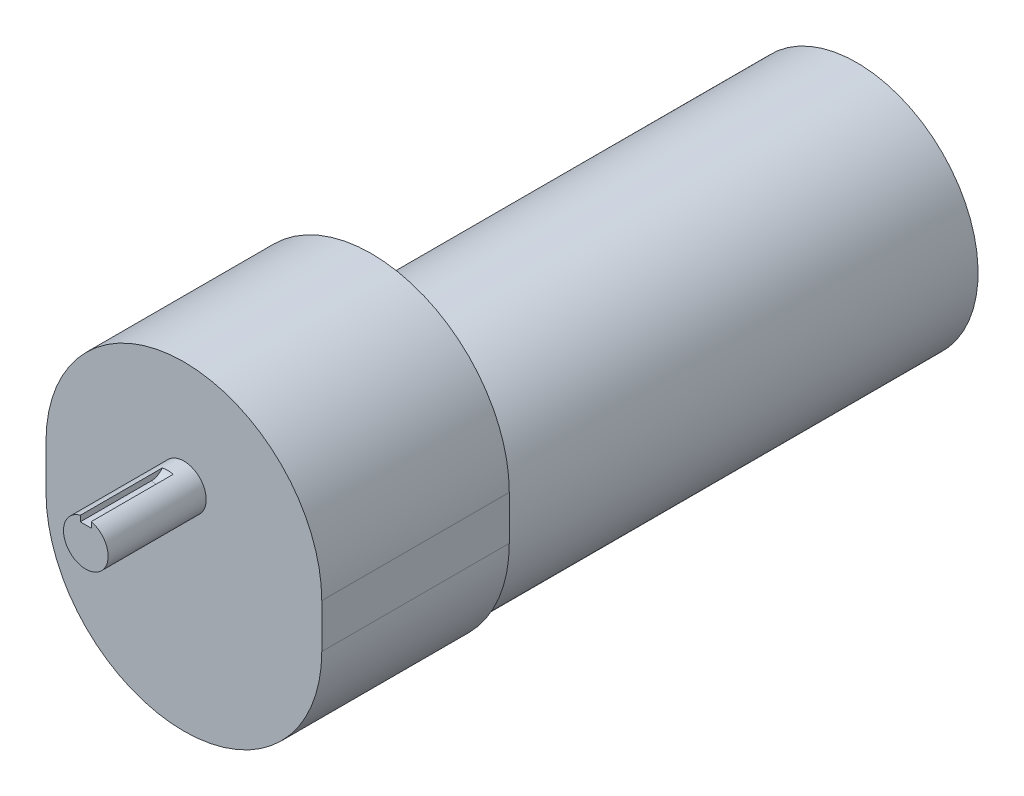
ISO-10303-21;
HEADER;
FILE_DESCRIPTION(('STEP AP214'),'2;1');
FILE_NAME('part.step','',(''),(''),'','','');
FILE_SCHEMA(('AUTOMOTIVE_DESIGN { 1 0 10303 214 1 1 1 1 }'));
ENDSEC;
DATA;
#1=APPLICATION_CONTEXT('core data for automotive mechanical design processes');
#2=APPLICATION_PROTOCOL_DEFINITION('international standard','automotive_design',2000,#1);
#3=PRODUCT_CONTEXT('',#1,'mechanical');
#4=PRODUCT('Part','Part','',(#3));
#5=PRODUCT_RELATED_PRODUCT_CATEGORY('part','',(#4));
#6=PRODUCT_DEFINITION_FORMATION('','',#4);
#7=PRODUCT_DEFINITION_CONTEXT('part definition',#1,'design');
#8=PRODUCT_DEFINITION('design','',#6,#7);
#9=PRODUCT_DEFINITION_SHAPE('','',#8);
#10=(LENGTH_UNIT() NAMED_UNIT(*) SI_UNIT(.MILLI.,.METRE.));
#11=(NAMED_UNIT(*) PLANE_ANGLE_UNIT() SI_UNIT($,.RADIAN.));
#12=(NAMED_UNIT(*) SI_UNIT($,.STERADIAN.) SOLID_ANGLE_UNIT());
#13=UNCERTAINTY_MEASURE_WITH_UNIT(LENGTH_MEASURE(1.E-05),#10,'distance_accuracy_value','');
#14=(GEOMETRIC_REPRESENTATION_CONTEXT(3) GLOBAL_UNCERTAINTY_ASSIGNED_CONTEXT((#13)) GLOBAL_UNIT_ASSIGNED_CONTEXT((#10,
#11,#12)) REPRESENTATION_CONTEXT('',''));
#15=CARTESIAN_POINT('',(0.,0.,0.));
#16=DIRECTION('',(0.,0.,1.));
#17=DIRECTION('',(1.,0.,0.));
#18=AXIS2_PLACEMENT_3D('',#15,#16,#17);
#19=CARTESIAN_POINT('',(0.,0.,-56.4642));
#20=DIRECTION('',(0.,0.,1.));
#21=DIRECTION('',(1.,0.,0.));
#22=AXIS2_PLACEMENT_3D('',#19,#20,#21);
#23=CYLINDRICAL_SURFACE('',#22,12.84605);
#24=DIRECTION('',(0.,0.,1.));
#25=VECTOR('',#24,1.);
#26=CARTESIAN_POINT('',(-3.1623,12.4507372999554,-47.1297));
#27=LINE('',#26,#25);
#28=CARTESIAN_POINT('',(-3.1623,12.4507372999554,-47.1297));
#29=VERTEX_POINT('',#28);
#30=CARTESIAN_POINT('',(-3.1623,12.4507372999554,0.));
#31=VERTEX_POINT('',#30);
#32=EDGE_CURVE('E117',#29,#31,#27,.T.);
#33=ORIENTED_EDGE('',*,*,#32,.F.);
#34=CARTESIAN_POINT('',(0.,-4.61436444609831E-13,-47.1297));
#35=DIRECTION('',(0.,0.,-1.));
#36=DIRECTION('',(-1.,0.,0.));
#37=AXIS2_PLACEMENT_3D('',#34,#35,#36);
#38=CIRCLE('',#37,12.8460500000004);
#39=CARTESIAN_POINT('',(3.1623,12.4507372999554,-47.1297));
#40=VERTEX_POINT('',#39);
#41=EDGE_CURVE('E106',#29,#40,#38,.T.);
#42=ORIENTED_EDGE('',*,*,#41,.T.);
#43=DIRECTION('',(0.,0.,1.));
#44=VECTOR('',#43,1.);
#45=CARTESIAN_POINT('',(3.1623,12.4507372999554,-47.1297));
#46=LINE('',#45,#44);
#47=CARTESIAN_POINT('',(3.1623,12.4507372999554,0.));
#48=VERTEX_POINT('',#47);
#49=EDGE_CURVE('E110',#40,#48,#46,.T.);
#50=ORIENTED_EDGE('',*,*,#49,.T.);
#51=CARTESIAN_POINT('',(0.,0.,0.));
#52=DIRECTION('',(0.,0.,1.));
#53=DIRECTION('',(1.,0.,0.));
#54=AXIS2_PLACEMENT_3D('',#51,#52,#53);
#55=CIRCLE('',#54,12.84605);
#56=EDGE_CURVE('E107',#31,#48,#55,.T.);
#57=ORIENTED_EDGE('',*,*,#56,.F.);
#58=EDGE_LOOP('',(#33,#42,#50,#57));
#59=FACE_BOUND('',#58,.T.);
#60=CARTESIAN_POINT('',(0.,0.,-56.4642));
#61=DIRECTION('',(0.,0.,1.));
#62=DIRECTION('',(1.,0.,0.));
#63=AXIS2_PLACEMENT_3D('',#60,#61,#62);
#64=CIRCLE('',#63,12.84605);
#65=CARTESIAN_POINT('',(12.84605,0.,-56.4642));
#66=VERTEX_POINT('',#65);
#67=EDGE_CURVE('E172',#66,#66,#64,.T.);
#68=ORIENTED_EDGE('',*,*,#67,.T.);
#69=EDGE_LOOP('',(#68));
#70=FACE_BOUND('',#69,.T.);
#71=ADVANCED_FACE('F32',(#59,#70),#23,.T.);
#72=CARTESIAN_POINT('',(0.,0.,0.));
#73=DIRECTION('',(0.,0.,1.));
#74=DIRECTION('',(1.,0.,0.));
#75=AXIS2_PLACEMENT_3D('',#72,#73,#74);
#76=PLANE('',#75);
#77=DIRECTION('',(0.,-1.,0.));
#78=VECTOR('',#77,1.);
#79=CARTESIAN_POINT('',(-3.1623,12.4507372999554,0.));
#80=LINE('',#79,#78);
#81=CARTESIAN_POINT('',(-3.1623,9.14873729995537,0.));
#82=VERTEX_POINT('',#81);
#83=EDGE_CURVE('E128',#31,#82,#80,.T.);
#84=ORIENTED_EDGE('',*,*,#83,.F.);
#85=ORIENTED_EDGE('',*,*,#56,.T.);
#86=DIRECTION('',(0.,1.,0.));
#87=VECTOR('',#86,1.);
#88=CARTESIAN_POINT('',(3.1623,9.14873729995537,0.));
#89=LINE('',#88,#87);
#90=CARTESIAN_POINT('',(3.1623,9.14873729995537,0.));
#91=VERTEX_POINT('',#90);
#92=EDGE_CURVE('E113',#91,#48,#89,.T.);
#93=ORIENTED_EDGE('',*,*,#92,.F.);
#94=DIRECTION('',(1.,0.,0.));
#95=VECTOR('',#94,1.);
#96=CARTESIAN_POINT('',(-3.1623,9.14873729995537,0.));
#97=LINE('',#96,#95);
#98=EDGE_CURVE('E125',#82,#91,#97,.T.);
#99=ORIENTED_EDGE('',*,*,#98,.F.);
#100=EDGE_LOOP('',(#84,#85,#93,#99));
#101=FACE_BOUND('',#100,.T.);
#102=ADVANCED_FACE('F217',(#101),#76,.T.);
#103=CARTESIAN_POINT('',(0.,-17.08785,-164.4142));
#104=DIRECTION('',(0.,0.,1.));
#105=DIRECTION('',(1.,0.,0.));
#106=AXIS2_PLACEMENT_3D('',#103,#104,#105);
#107=CYLINDRICAL_SURFACE('',#106,79.375);
#108=CARTESIAN_POINT('',(0.,-17.08785,-56.4642));
#109=DIRECTION('',(0.,0.,-1.));
#110=DIRECTION('',(-1.,0.,0.));
#111=AXIS2_PLACEMENT_3D('',#108,#109,#110);
#112=CIRCLE('',#111,79.375);
#113=CARTESIAN_POINT('',(-79.375,-17.08785,-56.4642));
#114=VERTEX_POINT('',#113);
#115=CARTESIAN_POINT('',(79.375,-17.08785,-56.4642));
#116=VERTEX_POINT('',#115);
#117=EDGE_CURVE('E139',#114,#116,#112,.T.);
#118=ORIENTED_EDGE('',*,*,#117,.T.);
#119=DIRECTION('',(0.,0.,1.));
#120=VECTOR('',#119,1.);
#121=CARTESIAN_POINT('',(79.375,-17.08785,-164.4142));
#122=LINE('',#121,#120);
#123=CARTESIAN_POINT('',(79.375,-17.08785,-164.4142));
#124=VERTEX_POINT('',#123);
#125=EDGE_CURVE('E169',#124,#116,#122,.T.);
#126=ORIENTED_EDGE('',*,*,#125,.F.);
#127=CARTESIAN_POINT('',(0.,-17.08785,-164.4142));
#128=DIRECTION('',(0.,0.,-1.));
#129=DIRECTION('',(-1.,0.,0.));
#130=AXIS2_PLACEMENT_3D('',#127,#128,#129);
#131=CIRCLE('',#130,79.375);
#132=CARTESIAN_POINT('',(-79.375,-17.08785,-164.4142));
#133=VERTEX_POINT('',#132);
#134=EDGE_CURVE('E142',#133,#124,#131,.T.);
#135=ORIENTED_EDGE('',*,*,#134,.F.);
#136=DIRECTION('',(0.,0.,1.));
#137=VECTOR('',#136,1.);
#138=CARTESIAN_POINT('',(-79.375,-17.08785,-164.4142));
#139=LINE('',#138,#137);
#140=EDGE_CURVE('E153',#133,#114,#139,.T.);
#141=ORIENTED_EDGE('',*,*,#140,.T.);
#142=EDGE_LOOP('',(#118,#126,#135,#141));
#143=FACE_BOUND('',#142,.T.);
#144=ADVANCED_FACE('F221',(#143),#107,.T.);
#145=CARTESIAN_POINT('',(79.375,-17.08785,-164.4142));
#146=DIRECTION('',(-1.,0.,0.));
#147=DIRECTION('',(0.,-1.,0.));
#148=AXIS2_PLACEMENT_3D('',#145,#146,#147);
#149=PLANE('',#148);
#150=DIRECTION('',(0.,-1.,0.));
#151=VECTOR('',#150,1.);
#152=CARTESIAN_POINT('',(79.375,-17.08785,-56.4642));
#153=LINE('',#152,#151);
#154=CARTESIAN_POINT('',(79.375,-42.48785,-56.4642));
#155=VERTEX_POINT('',#154);
#156=EDGE_CURVE('E156',#116,#155,#153,.T.);
#157=ORIENTED_EDGE('',*,*,#156,.T.);
#158=DIRECTION('',(0.,0.,1.));
#159=VECTOR('',#158,1.);
#160=CARTESIAN_POINT('',(79.375,-42.48785,-164.4142));
#161=LINE('',#160,#159);
#162=CARTESIAN_POINT('',(79.375,-42.48785,-164.4142));
#163=VERTEX_POINT('',#162);
#164=EDGE_CURVE('E166',#163,#155,#161,.T.);
#165=ORIENTED_EDGE('',*,*,#164,.F.);
#166=DIRECTION('',(0.,-1.,0.));
#167=VECTOR('',#166,1.);
#168=CARTESIAN_POINT('',(79.375,-17.08785,-164.4142));
#169=LINE('',#168,#167);
#170=EDGE_CURVE('E145',#124,#163,#169,.T.);
#171=ORIENTED_EDGE('',*,*,#170,.F.);
#172=ORIENTED_EDGE('',*,*,#125,.T.);
#173=EDGE_LOOP('',(#157,#165,#171,#172));
#174=FACE_BOUND('',#173,.T.);
#175=ADVANCED_FACE('F225',(#174),#149,.F.);
#176=CARTESIAN_POINT('',(0.,-42.48785,-164.4142));
#177=DIRECTION('',(0.,0.,1.));
#178=DIRECTION('',(1.,0.,0.));
#179=AXIS2_PLACEMENT_3D('',#176,#177,#178);
#180=CYLINDRICAL_SURFACE('',#179,79.375);
#181=CARTESIAN_POINT('',(0.,-42.48785,-56.4642));
#182=DIRECTION('',(0.,0.,-1.));
#183=DIRECTION('',(-1.,0.,0.));
#184=AXIS2_PLACEMENT_3D('',#181,#182,#183);
#185=CIRCLE('',#184,79.375);
#186=CARTESIAN_POINT('',(-79.375,-42.48785,-56.4642));
#187=VERTEX_POINT('',#186);
#188=EDGE_CURVE('E158',#155,#187,#185,.T.);
#189=ORIENTED_EDGE('',*,*,#188,.T.);
#190=DIRECTION('',(0.,0.,1.));
#191=VECTOR('',#190,1.);
#192=CARTESIAN_POINT('',(-79.375,-42.48785,-164.4142));
#193=LINE('',#192,#191);
#194=CARTESIAN_POINT('',(-79.375,-42.48785,-164.4142));
#195=VERTEX_POINT('',#194);
#196=EDGE_CURVE('E163',#195,#187,#193,.T.);
#197=ORIENTED_EDGE('',*,*,#196,.F.);
#198=CARTESIAN_POINT('',(0.,-42.48785,-164.4142));
#199=DIRECTION('',(0.,0.,-1.));
#200=DIRECTION('',(-1.,0.,0.));
#201=AXIS2_PLACEMENT_3D('',#198,#199,#200);
#202=CIRCLE('',#201,79.375);
#203=CARTESIAN_POINT('',(0.,-121.86285,-164.4142));
#204=VERTEX_POINT('',#203);
#205=EDGE_CURVE('E148',#204,#195,#202,.T.);
#206=ORIENTED_EDGE('',*,*,#205,.F.);
#207=EDGE_CURVE('E149',#163,#204,#202,.T.);
#208=ORIENTED_EDGE('',*,*,#207,.F.);
#209=ORIENTED_EDGE('',*,*,#164,.T.);
#210=EDGE_LOOP('',(#189,#197,#206,#208,#209));
#211=FACE_BOUND('',#210,.T.);
#212=ADVANCED_FACE('F229',(#211),#180,.T.);
#213=CARTESIAN_POINT('',(-79.375,-17.08785,-164.4142));
#214=DIRECTION('',(1.,0.,0.));
#215=DIRECTION('',(0.,1.,0.));
#216=AXIS2_PLACEMENT_3D('',#213,#214,#215);
#217=PLANE('',#216);
#218=DIRECTION('',(0.,1.,0.));
#219=VECTOR('',#218,1.);
#220=CARTESIAN_POINT('',(-79.375,-17.08785,-56.4642));
#221=LINE('',#220,#219);
#222=EDGE_CURVE('E146',#187,#114,#221,.T.);
#223=ORIENTED_EDGE('',*,*,#222,.T.);
#224=ORIENTED_EDGE('',*,*,#140,.F.);
#225=DIRECTION('',(0.,1.,0.));
#226=VECTOR('',#225,1.);
#227=CARTESIAN_POINT('',(-79.375,-17.08785,-164.4142));
#228=LINE('',#227,#226);
#229=EDGE_CURVE('E151',#195,#133,#228,.T.);
#230=ORIENTED_EDGE('',*,*,#229,.F.);
#231=ORIENTED_EDGE('',*,*,#196,.T.);
#232=EDGE_LOOP('',(#223,#224,#230,#231));
#233=FACE_BOUND('',#232,.T.);
#234=ADVANCED_FACE('F233',(#233),#217,.F.);
#235=CARTESIAN_POINT('',(0.,-17.08785,-164.4142));
#236=DIRECTION('',(0.,0.,-1.));
#237=DIRECTION('',(-1.,0.,0.));
#238=AXIS2_PLACEMENT_3D('',#235,#236,#237);
#239=PLANE('',#238);
#240=ORIENTED_EDGE('',*,*,#207,.T.);
#241=CARTESIAN_POINT('',(0.,-52.01285,-164.4142));
#242=DIRECTION('',(0.,0.,-1.));
#243=DIRECTION('',(-1.,0.,0.));
#244=AXIS2_PLACEMENT_3D('',#241,#242,#243);
#245=CIRCLE('',#244,69.85);
#246=EDGE_CURVE('E133',#204,#204,#245,.T.);
#247=ORIENTED_EDGE('',*,*,#246,.F.);
#248=ORIENTED_EDGE('',*,*,#205,.T.);
#249=ORIENTED_EDGE('',*,*,#229,.T.);
#250=ORIENTED_EDGE('',*,*,#134,.T.);
#251=ORIENTED_EDGE('',*,*,#170,.T.);
#252=EDGE_LOOP('',(#240,#247,#248,#249,#250,#251));
#253=FACE_BOUND('',#252,.T.);
#254=ADVANCED_FACE('F237',(#253),#239,.T.);
#255=CARTESIAN_POINT('',(0.,-17.08785,-56.4642));
#256=DIRECTION('',(0.,0.,-1.));
#257=DIRECTION('',(-1.,0.,0.));
#258=AXIS2_PLACEMENT_3D('',#255,#256,#257);
#259=PLANE('',#258);
#260=ORIENTED_EDGE('',*,*,#67,.F.);
#261=EDGE_LOOP('',(#260));
#262=FACE_BOUND('',#261,.T.);
#263=ORIENTED_EDGE('',*,*,#117,.F.);
#264=ORIENTED_EDGE('',*,*,#222,.F.);
#265=ORIENTED_EDGE('',*,*,#188,.F.);
#266=ORIENTED_EDGE('',*,*,#156,.F.);
#267=EDGE_LOOP('',(#263,#264,#265,#266));
#268=FACE_BOUND('',#267,.T.);
#269=ADVANCED_FACE('F239',(#262,#268),#259,.F.);
#270=CARTESIAN_POINT('',(0.,-52.01285,-443.8142));
#271=DIRECTION('',(0.,0.,1.));
#272=DIRECTION('',(1.,0.,0.));
#273=AXIS2_PLACEMENT_3D('',#270,#271,#272);
#274=CYLINDRICAL_SURFACE('',#273,69.85);
#275=CARTESIAN_POINT('',(0.,-52.01285,-443.8142));
#276=DIRECTION('',(0.,0.,-1.));
#277=DIRECTION('',(-1.,0.,0.));
#278=AXIS2_PLACEMENT_3D('',#275,#276,#277);
#279=CIRCLE('',#278,69.85);
#280=CARTESIAN_POINT('',(-69.85,-52.01285,-443.8142));
#281=VERTEX_POINT('',#280);
#282=EDGE_CURVE('E136',#281,#281,#279,.T.);
#283=ORIENTED_EDGE('',*,*,#282,.F.);
#284=EDGE_LOOP('',(#283));
#285=FACE_BOUND('',#284,.T.);
#286=ORIENTED_EDGE('',*,*,#246,.T.);
#287=EDGE_LOOP('',(#286));
#288=FACE_BOUND('',#287,.T.);
#289=ADVANCED_FACE('F242',(#285,#288),#274,.T.);
#290=CARTESIAN_POINT('',(0.,-52.01285,-443.8142));
#291=DIRECTION('',(0.,0.,-1.));
#292=DIRECTION('',(-1.,0.,0.));
#293=AXIS2_PLACEMENT_3D('',#290,#291,#292);
#294=PLANE('',#293);
#295=ORIENTED_EDGE('',*,*,#282,.T.);
#296=EDGE_LOOP('',(#295));
#297=FACE_BOUND('',#296,.T.);
#298=ADVANCED_FACE('F203',(#297),#294,.T.);
#299=CARTESIAN_POINT('',(-3.1623,12.4507372999554,-47.1297));
#300=DIRECTION('',(-1.,0.,0.));
#301=DIRECTION('',(0.,-1.,0.));
#302=AXIS2_PLACEMENT_3D('',#299,#300,#301);
#303=PLANE('',#302);
#304=DIRECTION('',(0.,0.,1.));
#305=VECTOR('',#304,1.);
#306=CARTESIAN_POINT('',(-3.1623,9.14873729995537,-47.1297));
#307=LINE('',#306,#305);
#308=CARTESIAN_POINT('',(-3.1623,9.14873729995537,-40.783781738594));
#309=VERTEX_POINT('',#308);
#310=EDGE_CURVE('E122',#309,#82,#307,.T.);
#311=ORIENTED_EDGE('',*,*,#310,.F.);
#312=CARTESIAN_POINT('',(-3.91092830754341,12.2362429027768,-47.1297));
#313=CARTESIAN_POINT('',(-4.45123569117235,9.14873729995537,-44.9099199636426));
#314=CARTESIAN_POINT('',(-5.35959693830714,9.14873729995537,-41.1780402535271));
#315=CARTESIAN_POINT('',(-3.71723910992375,12.2982002815097,-47.1297));
#316=CARTESIAN_POINT('',(-4.21534293677263,9.14873729995537,-44.9024050795866));
#317=CARTESIAN_POINT('',(-5.06692976185523,9.14873729995537,-41.1068785002261));
#318=CARTESIAN_POINT('',(-3.5177693613178,12.3568362637665,-47.1297));
#319=CARTESIAN_POINT('',(-3.97702023085459,9.14873729995537,-44.8978177025605));
#320=CARTESIAN_POINT('',(-4.77242667616507,9.14873729995537,-41.0436923080129));
#321=CARTESIAN_POINT('',(-3.10900672080777,12.4659323475589,-47.1297));
#322=CARTESIAN_POINT('',(-3.49504085739714,9.14873729995537,-44.8926269690075));
#323=CARTESIAN_POINT('',(-4.180858820644,9.14873729995537,-40.9316182512152));
#324=CARTESIAN_POINT('',(-2.89971908118786,12.516396757744,-47.1297));
#325=CARTESIAN_POINT('',(-3.25151851987675,9.14873729995537,-44.8920413900361));
#326=CARTESIAN_POINT('',(-3.88379548836421,9.14873729995537,-40.8827228404668));
#327=CARTESIAN_POINT('',(-2.47308217147747,12.6076357408893,-47.1297));
#328=CARTESIAN_POINT('',(-2.76031257732497,9.14873729995537,-44.8930121087345));
#329=CARTESIAN_POINT('',(-3.2882293745563,9.14873729995537,-40.7975521257478));
#330=CARTESIAN_POINT('',(-2.25574190867642,12.6484207837111,-47.1297));
#331=CARTESIAN_POINT('',(-2.51281061565514,9.14873729995537,-44.8945739730221));
#332=CARTESIAN_POINT('',(-2.98972850797811,9.14873729995537,-40.7612631658888));
#333=CARTESIAN_POINT('',(-1.81462376264849,12.7191988465209,-47.1297));
#334=CARTESIAN_POINT('',(-2.01429362737737,9.14873729995537,-44.8983785266044));
#335=CARTESIAN_POINT('',(-2.39153261581122,9.14873729995537,-40.6999876345882));
#336=CARTESIAN_POINT('',(-1.590844888632,12.7491901958523,-47.1297));
#337=CARTESIAN_POINT('',(-1.763494911451,9.14873729995537,-44.9006216497635));
#338=CARTESIAN_POINT('',(-2.09183741261411,9.14873729995537,-40.6750028126566));
#339=CARTESIAN_POINT('',(-1.14305229754868,12.7970389914693,-47.1297));
#340=CARTESIAN_POINT('',(-1.26406697544247,9.14873729995537,-44.9046331883708));
#341=CARTESIAN_POINT('',(-1.49726393687296,9.14873729995537,-40.6357978406358));
#342=CARTESIAN_POINT('',(-0.919117871149121,12.8151085121306,-47.1297));
#343=CARTESIAN_POINT('',(-1.0157090535498,9.14873729995537,-44.9064068077857));
#344=CARTESIAN_POINT('',(-1.20239791720385,9.14873729995537,-40.6213890037471));
#345=CARTESIAN_POINT('',(-0.469080646089499,12.8394604237661,-47.1297));
#346=CARTESIAN_POINT('',(-0.517644840746492,9.14873729995537,-44.9088730731564));
#347=CARTESIAN_POINT('',(-0.612353779758513,9.14873729995537,-40.6020817742092));
#348=CARTESIAN_POINT('',(-0.242977813587631,12.8457426304767,-47.1297));
#349=CARTESIAN_POINT('',(-0.268190901282934,9.14873729995537,-44.9095633061377));
#350=CARTESIAN_POINT('',(-0.317175657175556,9.14873729995537,-40.597183530233));
#351=CARTESIAN_POINT('',(0.209383586188507,12.8463354061925,-47.1297));
#352=CARTESIAN_POINT('',(0.231116839411978,9.14873729995537,-44.9096263784614));
#353=CARTESIAN_POINT('',(0.273323013782881,9.14873729995537,-40.5967181043979));
#354=CARTESIAN_POINT('',(0.435642177629934,12.840640555066,-47.1297));
#355=CARTESIAN_POINT('',(0.480711564710181,9.14873729995537,-44.9089985549205));
#356=CARTESIAN_POINT('',(0.568643566148974,9.14873729995537,-40.6011551471566));
#357=CARTESIAN_POINT('',(0.886084958182122,12.8174388700689,-47.1297));
#358=CARTESIAN_POINT('',(0.979098863453171,9.14873729995537,-44.9066377561598));
#359=CARTESIAN_POINT('',(1.15897561809566,9.14873729995537,-40.6195338992852));
#360=CARTESIAN_POINT('',(1.11026922151286,12.7999324604886,-47.1297));
#361=CARTESIAN_POINT('',(1.22763823782921,9.14873729995537,-44.9049071315416));
#362=CARTESIAN_POINT('',(1.45398712839631,9.14873729995537,-40.6334752672446));
#363=CARTESIAN_POINT('',(1.62821319071351,12.7459115341953,-47.1297));
#364=CARTESIAN_POINT('',(1.80484568355701,9.14873729995537,-44.9003107121987));
#365=CARTESIAN_POINT('',(2.14115976807188,9.14873729995537,-40.6776316837685));
#366=CARTESIAN_POINT('',(1.92038331683203,12.7050179911725,-47.1297));
#367=CARTESIAN_POINT('',(2.13251228342789,9.14873729995537,-44.897262772639));
#368=CARTESIAN_POINT('',(2.53308444471769,9.14873729995537,-40.7117109837875));
#369=CARTESIAN_POINT('',(2.49263460625798,12.6052422832019,-47.1297));
#370=CARTESIAN_POINT('',(2.78202665364715,9.14873729995537,-44.8928918082904));
#371=CARTESIAN_POINT('',(3.31440486840877,9.14873729995537,-40.7996367591525));
#372=CARTESIAN_POINT('',(2.77272565899204,12.546375165477,-47.1297));
#373=CARTESIAN_POINT('',(3.10341406258362,9.14873729995537,-44.8915633529011));
#374=CARTESIAN_POINT('',(3.70380245366492,9.14873729995537,-40.8534667071095));
#375=CARTESIAN_POINT('',(3.32045487086127,12.4127346819878,-47.1297));
#376=CARTESIAN_POINT('',(3.74221855819361,9.14873729995537,-44.8942779783282));
#377=CARTESIAN_POINT('',(4.48358429638776,9.14873729995537,-40.9848398506327));
#378=CARTESIAN_POINT('',(3.587899869646,12.337776362313,-47.1297));
#379=CARTESIAN_POINT('',(4.0592091922898,9.14873729995537,-44.8983544462489));
#380=CARTESIAN_POINT('',(4.873922833467,9.14873729995537,-41.0626638086348));
#381=CARTESIAN_POINT('',(3.97449263418936,12.2164951961473,-47.1297));
#382=CARTESIAN_POINT('',(4.52774239777635,9.14873729995537,-44.912042290986));
#383=CARTESIAN_POINT('',(5.45486460368325,9.14873729995537,-41.2002903496252));
#384=CARTESIAN_POINT('',(4.10104897401579,12.1745470392699,-47.1297));
#385=CARTESIAN_POINT('',(4.68248621194512,9.14873729995537,-44.9178516019382));
#386=CARTESIAN_POINT('',(5.647944791342,9.14873729995537,-41.2497085255456));
#387=CARTESIAN_POINT('',(4.34887842368631,12.0882378255048,-47.1297));
#388=CARTESIAN_POINT('',(4.98893970864208,9.14873729995537,-44.9326260183941));
#389=CARTESIAN_POINT('',(6.03205101386876,9.14873729995537,-41.3561774811775));
#390=CARTESIAN_POINT('',(4.47014981709154,12.0438759950712,-47.1297));
#391=CARTESIAN_POINT('',(5.14063232203714,9.14873729995537,-44.9415797737577));
#392=CARTESIAN_POINT('',(6.2230763664206,9.14873729995537,-41.4132307164627));
#393=CARTESIAN_POINT('',(4.58857913417453,11.9985808382458,-47.1297));
#394=CARTESIAN_POINT('',(5.29090198972323,9.14873729995537,-44.9524424500557));
#395=CARTESIAN_POINT('',(6.41281490856339,9.14873729995537,-41.4744218308687));
#396=(BOUNDED_SURFACE() B_SPLINE_SURFACE(3,2,((#312,#313,#314),(#315,#316,#317),(#318,#319,
#320),(#321,#322,#323),(#324,#325,#326),(#327,#328,#329),(#330,#331,#332),(#333,#334,#335),
(#336,#337,#338),(#339,#340,#341),(#342,#343,#344),(#345,#346,#347),(#348,#349,#350),(#351,#352,
#353),(#354,#355,#356),(#357,#358,#359),(#360,#361,#362),(#363,#364,#365),(#366,#367,#368),
(#369,#370,#371),(#372,#373,#374),(#375,#376,#377),(#378,#379,#380),(#381,#382,#383),(#384,#385,
#386),(#387,#388,#389),(#390,#391,#392),(#393,#394,#395)),.UNSPECIFIED.,.F.,.F.,
.F.) B_SPLINE_SURFACE_WITH_KNOTS((4,2,2,2,2,2,2,2,2,2,2,2,2,4),(3,3),(0.,0.903326288779632,
1.80617471601215,2.70804206404985,3.6100489438692,4.49554356016404,5.38105201872663,
6.26696129403087,7.15283874774255,8.33258307476952,9.51134243213093,10.7044549154261,
11.3022276768998,11.9001931570832),(0.,1.),
.UNSPECIFIED.) GEOMETRIC_REPRESENTATION_ITEM() RATIONAL_B_SPLINE_SURFACE(((1.,0.8929769139478,
1.),(1.,0.89070072620856,1.),(1.,0.88853754254074,1.),(1.,0.884500021248072,1.),(1.,
0.882625531428399,1.),(1.,0.87922754415603,1.),(1.,0.877703667511295,1.),(1.,0.875054001065055,
1.),(1.,0.873928272889757,1.),(1.,0.872130108273851,1.),(1.,0.871449751059736,1.),(1.,
0.870532469180741,1.),(1.,0.870295551447873,1.),(1.,0.87027320659553,1.),(1.,0.870487983887406,
1.),(1.,0.871361998605425,1.),(1.,0.872021220066417,1.),(1.,0.87405166331623,1.),(1.,
0.875586531455696,1.),(1.,0.879317146651481,1.),(1.,0.881512340869467,1.),(1.,0.886472289232815,
1.),(1.,0.889243653133071,1.),(1.,0.89370340538639,1.),(1.,0.895242159169189,1.),(1.,
0.898399634460868,1.),(1.,0.900018381590974,1.),(1.,0.90166645301942,1.))) REPRESENTATION_ITEM('') SURFACE());
#397=CARTESIAN_POINT('',(-3.16230000000105,9.14873729995537,-40.783781738594));
#398=CARTESIAN_POINT('',(-3.16230000000038,9.14871493096595,-41.0009513616138));
#399=CARTESIAN_POINT('',(-3.1623000000001,9.15788156975013,-41.2181158099122));
#400=CARTESIAN_POINT('',(-3.1622999999999,9.19440634412196,-41.6508976923303));
#401=CARTESIAN_POINT('',(-3.16229999999998,9.22176343408567,-41.8665152146505));
#402=CARTESIAN_POINT('',(-3.16230000000003,9.29444911329436,-42.2944945332251));
#403=CARTESIAN_POINT('',(-3.16230000000001,9.33976111186311,-42.5068591476009));
#404=CARTESIAN_POINT('',(-3.1623,9.44801740538855,-42.927042202569));
#405=CARTESIAN_POINT('',(-3.1623,9.51096148389879,-43.1348606989345));
#406=CARTESIAN_POINT('',(-3.1623,9.65435452305807,-43.5454119238675));
#407=CARTESIAN_POINT('',(-3.1623,9.73488048566277,-43.7481177614014));
#408=CARTESIAN_POINT('',(-3.1623,9.91273495830537,-44.1461124377682));
#409=CARTESIAN_POINT('',(-3.1623,10.0100698544343,-44.3413984231043));
#410=CARTESIAN_POINT('',(-3.1623,10.2207538639926,-44.7229260003144));
#411=CARTESIAN_POINT('',(-3.1623,10.3340901540467,-44.9091746755592));
#412=CARTESIAN_POINT('',(-3.1623,10.5760882234744,-45.2715328852538));
#413=CARTESIAN_POINT('',(-3.1623,10.7047548824867,-45.4476391647906));
#414=CARTESIAN_POINT('',(-3.1623,10.9557553408094,-45.7623517942156));
#415=CARTESIAN_POINT('',(-3.1623,11.0760619217749,-45.9025809789162));
#416=CARTESIAN_POINT('',(-3.1623,11.3264129890351,-46.1740594363017));
#417=CARTESIAN_POINT('',(-3.1623,11.4564571098219,-46.3053090456901));
#418=CARTESIAN_POINT('',(-3.1623,11.7256870016792,-46.5581612293676));
#419=CARTESIAN_POINT('',(-3.1623,11.8648757183438,-46.6797606670856));
#420=CARTESIAN_POINT('',(-3.1623,12.1516729359595,-46.9126395177807));
#421=CARTESIAN_POINT('',(-3.1623,12.2992828755784,-47.0239171588208));
#422=CARTESIAN_POINT('',(-3.1623,12.4507372999561,-47.1296999999994));
#423=B_SPLINE_CURVE_WITH_KNOTS('',3,(#397,#398,#399,#400,#401,#402,#403,#404,#405,#406,#407,
#408,#409,#410,#411,#412,#413,#414,#415,#416,#417,#418,#419,#420,#421,#422),.UNSPECIFIED.,.F.,
.F.,(4,2,2,2,2,2,2,2,2,2,2,2,4),(0.,0.651308136919296,1.30257883856492,1.95324915180935,
2.60391147795794,3.25748275674285,3.9113028904022,4.56460200154468,5.21810961536354,
5.77194390643685,6.32575741922507,6.87975020562312,7.43383792031033),.UNSPECIFIED.);
#424=EDGE_CURVE('E11',#309,#29,#423,.T.);
#425=ORIENTED_EDGE('',*,*,#424,.T.);
#426=ORIENTED_EDGE('',*,*,#32,.T.);
#427=ORIENTED_EDGE('',*,*,#83,.T.);
#428=EDGE_LOOP('',(#311,#425,#426,#427));
#429=FACE_BOUND('',#428,.T.);
#430=ADVANCED_FACE('F194',(#429),#303,.F.);
#431=CARTESIAN_POINT('',(3.1623,9.14873729995537,-47.1297));
#432=DIRECTION('',(1.,0.,0.));
#433=DIRECTION('',(0.,1.,0.));
#434=AXIS2_PLACEMENT_3D('',#431,#432,#433);
#435=PLANE('',#434);
#436=ORIENTED_EDGE('',*,*,#49,.F.);
#437=CARTESIAN_POINT('',(3.1623,12.4507372999554,-47.1297));
#438=CARTESIAN_POINT('',(3.1623,12.2725978840362,-47.0052975252289));
#439=CARTESIAN_POINT('',(3.1623,12.0997875971108,-46.8732816386799));
#440=CARTESIAN_POINT('',(3.1623,11.7659741823283,-46.5951100231709));
#441=CARTESIAN_POINT('',(3.1623,11.6049699688805,-46.4489555971498));
#442=CARTESIAN_POINT('',(3.1623,11.2960837916017,-46.1437676023523));
#443=CARTESIAN_POINT('',(3.1623,11.1481851640262,-45.9847508950269));
#444=CARTESIAN_POINT('',(3.1623,10.8662862353169,-45.6548447266522));
#445=CARTESIAN_POINT('',(3.1623,10.7322858407279,-45.4839553454507));
#446=CARTESIAN_POINT('',(3.1623,10.4793552411697,-45.1318758788714));
#447=CARTESIAN_POINT('',(3.1623,10.3603960032006,-44.9507066470591));
#448=CARTESIAN_POINT('',(3.1623,10.138000328765,-44.5789647053056));
#449=CARTESIAN_POINT('',(3.1623,10.03457109341,-44.3883876871538));
#450=CARTESIAN_POINT('',(3.1623,9.84404337267109,-43.9993030084148));
#451=CARTESIAN_POINT('',(3.1623,9.75694059933603,-43.8007974468267));
#452=CARTESIAN_POINT('',(3.1623,9.59967238648652,-43.3972921244981));
#453=CARTESIAN_POINT('',(3.1623,9.52949851477986,-43.1922956546454));
#454=CARTESIAN_POINT('',(3.1623,9.41520287102126,-42.8064260365828));
#455=CARTESIAN_POINT('',(3.1623,9.36880357332346,-42.6262233111288));
#456=CARTESIAN_POINT('',(3.1623,9.28907452929176,-42.2629633353342));
#457=CARTESIAN_POINT('',(3.1623,9.25574338622958,-42.0799063922288));
#458=CARTESIAN_POINT('',(3.1623,9.20232934448446,-41.7118343882662));
#459=CARTESIAN_POINT('',(3.1623,9.1822490373595,-41.5268189515575));
#460=CARTESIAN_POINT('',(3.1623,9.15544625370158,-41.1557974223179));
#461=CARTESIAN_POINT('',(3.1623,9.14872564375418,-40.9697911949958));
#462=CARTESIAN_POINT('',(3.1623,9.14873729995537,-40.7837817385938));
#463=B_SPLINE_CURVE_WITH_KNOTS('',3,(#437,#438,#439,#440,#441,#442,#443,#444,#445,#446,#447,
#448,#449,#450,#451,#452,#453,#454,#455,#456,#457,#458,#459,#460,#461,#462),.UNSPECIFIED.,.F.,
.F.,(4,2,2,2,2,2,2,2,2,2,2,2,4),(0.,0.651622461516987,1.30318492979182,1.95390667893518,
2.60462405217066,3.25406556283008,3.90380728937258,4.5533781291301,5.20262475010699,
5.76039941540763,6.31811444932318,6.87593852713715,7.43384053734652),.UNSPECIFIED.);
#464=CARTESIAN_POINT('',(3.1623,9.14873729995537,-40.7837817385938));
#465=VERTEX_POINT('',#464);
#466=EDGE_CURVE('E60',#40,#465,#463,.T.);
#467=ORIENTED_EDGE('',*,*,#466,.T.);
#468=DIRECTION('',(0.,0.,1.));
#469=VECTOR('',#468,1.);
#470=CARTESIAN_POINT('',(3.1623,9.14873729995537,-47.1297));
#471=LINE('',#470,#469);
#472=EDGE_CURVE('E118',#465,#91,#471,.T.);
#473=ORIENTED_EDGE('',*,*,#472,.T.);
#474=ORIENTED_EDGE('',*,*,#92,.T.);
#475=EDGE_LOOP('',(#436,#467,#473,#474));
#476=FACE_BOUND('',#475,.T.);
#477=ADVANCED_FACE('F111',(#476),#435,.F.);
#478=CARTESIAN_POINT('',(-3.1623,9.14873729995537,-47.1297));
#479=DIRECTION('',(0.,-1.,0.));
#480=DIRECTION('',(0.,0.,-1.));
#481=AXIS2_PLACEMENT_3D('',#478,#479,#480);
#482=PLANE('',#481);
#483=ORIENTED_EDGE('',*,*,#472,.F.);
#484=CARTESIAN_POINT('',(6.41281490856339,9.14873729995537,-41.4744218308687));
#485=CARTESIAN_POINT('',(6.2230763664206,9.14873729995537,-41.4132307164627));
#486=CARTESIAN_POINT('',(6.03205101386877,9.14873729995537,-41.3561774811775));
#487=CARTESIAN_POINT('',(5.647944791342,9.14873729995537,-41.2497085255456));
#488=CARTESIAN_POINT('',(5.45486460368325,9.14873729995537,-41.2002903496252));
#489=CARTESIAN_POINT('',(4.873922833467,9.14873729995537,-41.0626638086348));
#490=CARTESIAN_POINT('',(4.48358429638776,9.14873729995537,-40.9848398506327));
#491=CARTESIAN_POINT('',(3.70380245366492,9.14873729995537,-40.8534667071095));
#492=CARTESIAN_POINT('',(3.31440486840877,9.14873729995537,-40.7996367591525));
#493=CARTESIAN_POINT('',(2.53308444471769,9.14873729995537,-40.7117109837875));
#494=CARTESIAN_POINT('',(2.14115976807188,9.14873729995537,-40.6776316837685));
#495=CARTESIAN_POINT('',(1.45398712839631,9.14873729995537,-40.6334752672446));
#496=CARTESIAN_POINT('',(1.15897561809566,9.14873729995537,-40.6195338992852));
#497=CARTESIAN_POINT('',(0.568643566148974,9.14873729995537,-40.6011551471566));
#498=CARTESIAN_POINT('',(0.273323013782881,9.14873729995537,-40.5967181043979));
#499=CARTESIAN_POINT('',(-0.317175657175556,9.14873729995537,-40.597183530233));
#500=CARTESIAN_POINT('',(-0.612353779758513,9.14873729995537,-40.6020817742092));
#501=CARTESIAN_POINT('',(-1.20239791720385,9.14873729995537,-40.6213890037471));
#502=CARTESIAN_POINT('',(-1.49726393687296,9.14873729995537,-40.6357978406358));
#503=CARTESIAN_POINT('',(-2.09183741261411,9.14873729995537,-40.6750028126566));
#504=CARTESIAN_POINT('',(-2.39153261581122,9.14873729995537,-40.6999876345882));
#505=CARTESIAN_POINT('',(-2.98972850797812,9.14873729995537,-40.7612631658888));
#506=CARTESIAN_POINT('',(-3.28822937455631,9.14873729995537,-40.7975521257478));
#507=CARTESIAN_POINT('',(-3.88379548836421,9.14873729995537,-40.8827228404668));
#508=CARTESIAN_POINT('',(-4.180858820644,9.14873729995537,-40.9316182512152));
#509=CARTESIAN_POINT('',(-4.77242667616507,9.14873729995537,-41.0436923080129));
#510=CARTESIAN_POINT('',(-5.06692976185523,9.14873729995537,-41.1068785002261));
#511=CARTESIAN_POINT('',(-5.35959693830714,9.14873729995537,-41.1780402535271));
#512=B_SPLINE_CURVE_WITH_KNOTS('',3,(#484,#485,#486,#487,#488,#489,#490,#491,#492,#493,#494,
#495,#496,#497,#498,#499,#500,#501,#502,#503,#504,#505,#506,#507,#508,#509,#510,#511),
.UNSPECIFIED.,.F.,.F.,(4,2,2,2,2,2,2,2,2,2,2,2,2,4),(0.,0.597965480183392,1.19573824165712,
2.3888507249523,3.56761008231372,4.74735440934069,5.63323186305237,6.51914113835661,
7.40464959691919,8.29014421321404,9.19215109303339,10.0940184410711,10.9968668683036,
11.9001931570832),.UNSPECIFIED.);
#513=EDGE_CURVE('E45',#465,#309,#512,.T.);
#514=ORIENTED_EDGE('',*,*,#513,.T.);
#515=ORIENTED_EDGE('',*,*,#310,.T.);
#516=ORIENTED_EDGE('',*,*,#98,.T.);
#517=EDGE_LOOP('',(#483,#514,#515,#516));
#518=FACE_BOUND('',#517,.T.);
#519=ADVANCED_FACE('F193',(#518),#482,.F.);
#520=ORIENTED_EDGE('',*,*,#424,.F.);
#521=ORIENTED_EDGE('',*,*,#513,.F.);
#522=ORIENTED_EDGE('',*,*,#466,.F.);
#523=ORIENTED_EDGE('',*,*,#41,.F.);
#524=EDGE_LOOP('',(#520,#521,#522,#523));
#525=FACE_BOUND('',#524,.T.);
#526=ADVANCED_FACE('F104',(#525),#396,.F.);
#527=CLOSED_SHELL('',(#71,#102,#144,#175,#212,#234,#254,#269,#289,#298,#430,#477,#519,#526));
#528=MANIFOLD_SOLID_BREP('B2',#527);
#529=ADVANCED_BREP_SHAPE_REPRESENTATION('',(#18,#528),#14);
#530=SHAPE_DEFINITION_REPRESENTATION(#9,#529);
ENDSEC;
END-ISO-10303-21;
